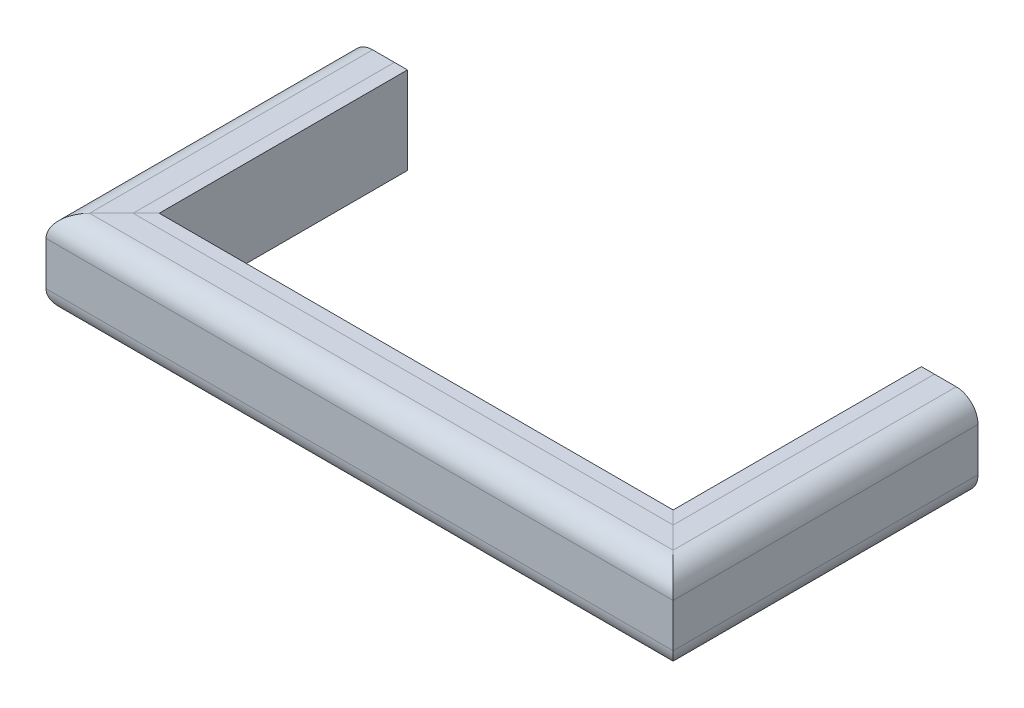
ISO-10303-21;
HEADER;
FILE_DESCRIPTION(('STEP AP214'),'2;1');
FILE_NAME('part.step','',(''),(''),'','','');
FILE_SCHEMA(('AUTOMOTIVE_DESIGN { 1 0 10303 214 1 1 1 1 }'));
ENDSEC;
DATA;
#1=APPLICATION_CONTEXT('core data for automotive mechanical design processes');
#2=APPLICATION_PROTOCOL_DEFINITION('international standard','automotive_design',2000,#1);
#3=PRODUCT_CONTEXT('',#1,'mechanical');
#4=PRODUCT('Part','Part','',(#3));
#5=PRODUCT_RELATED_PRODUCT_CATEGORY('part','',(#4));
#6=PRODUCT_DEFINITION_FORMATION('','',#4);
#7=PRODUCT_DEFINITION_CONTEXT('part definition',#1,'design');
#8=PRODUCT_DEFINITION('design','',#6,#7);
#9=PRODUCT_DEFINITION_SHAPE('','',#8);
#10=(LENGTH_UNIT() NAMED_UNIT(*) SI_UNIT(.MILLI.,.METRE.));
#11=(NAMED_UNIT(*) PLANE_ANGLE_UNIT() SI_UNIT($,.RADIAN.));
#12=(NAMED_UNIT(*) SI_UNIT($,.STERADIAN.) SOLID_ANGLE_UNIT());
#13=UNCERTAINTY_MEASURE_WITH_UNIT(LENGTH_MEASURE(1.E-05),#10,'distance_accuracy_value','');
#14=(GEOMETRIC_REPRESENTATION_CONTEXT(3) GLOBAL_UNCERTAINTY_ASSIGNED_CONTEXT((#13)) GLOBAL_UNIT_ASSIGNED_CONTEXT((#10,
#11,#12)) REPRESENTATION_CONTEXT('',''));
#15=CARTESIAN_POINT('',(0.,0.,0.));
#16=DIRECTION('',(0.,0.,1.));
#17=DIRECTION('',(1.,0.,0.));
#18=AXIS2_PLACEMENT_3D('',#15,#16,#17);
#19=CARTESIAN_POINT('',(425.45,95.2500000000001,0.));
#20=DIRECTION('',(0.,0.,-1.));
#21=DIRECTION('',(-1.,0.,0.));
#22=AXIS2_PLACEMENT_3D('',#19,#20,#21);
#23=PLANE('',#22);
#24=DIRECTION('',(0.,1.,0.));
#25=VECTOR('',#24,1.);
#26=CARTESIAN_POINT('',(374.65,0.,0.));
#27=LINE('',#26,#25);
#28=CARTESIAN_POINT('',(374.65,0.,0.));
#29=VERTEX_POINT('',#28);
#30=CARTESIAN_POINT('',(374.65,127.,0.));
#31=VERTEX_POINT('',#30);
#32=EDGE_CURVE('E107',#29,#31,#27,.T.);
#33=ORIENTED_EDGE('',*,*,#32,.T.);
#34=DIRECTION('',(1.,0.,0.));
#35=VECTOR('',#34,1.);
#36=CARTESIAN_POINT('',(374.65,127.,0.));
#37=LINE('',#36,#35);
#38=CARTESIAN_POINT('',(393.7,127.,0.));
#39=VERTEX_POINT('',#38);
#40=EDGE_CURVE('E126',#31,#39,#37,.T.);
#41=ORIENTED_EDGE('',*,*,#40,.T.);
#42=DIRECTION('',(1.,0.,0.));
#43=VECTOR('',#42,1.);
#44=CARTESIAN_POINT('',(393.7,127.,0.));
#45=LINE('',#44,#43);
#46=CARTESIAN_POINT('',(425.45,127.,0.));
#47=VERTEX_POINT('',#46);
#48=EDGE_CURVE('E153',#39,#47,#45,.T.);
#49=ORIENTED_EDGE('',*,*,#48,.T.);
#50=CARTESIAN_POINT('',(425.45,95.2500000000001,0.));
#51=DIRECTION('',(0.,0.,-1.));
#52=DIRECTION('',(-1.,0.,0.));
#53=AXIS2_PLACEMENT_3D('',#50,#51,#52);
#54=CIRCLE('',#53,31.75);
#55=CARTESIAN_POINT('',(457.2,95.2500000000001,0.));
#56=VERTEX_POINT('',#55);
#57=EDGE_CURVE('E155',#47,#56,#54,.T.);
#58=ORIENTED_EDGE('',*,*,#57,.T.);
#59=DIRECTION('',(0.,-1.,0.));
#60=VECTOR('',#59,1.);
#61=CARTESIAN_POINT('',(457.2,95.2500000000001,0.));
#62=LINE('',#61,#60);
#63=CARTESIAN_POINT('',(457.2,31.7500000000001,0.));
#64=VERTEX_POINT('',#63);
#65=EDGE_CURVE('E157',#56,#64,#62,.T.);
#66=ORIENTED_EDGE('',*,*,#65,.T.);
#67=CARTESIAN_POINT('',(425.45,31.7500000000001,0.));
#68=DIRECTION('',(0.,0.,-1.));
#69=DIRECTION('',(-1.,0.,0.));
#70=AXIS2_PLACEMENT_3D('',#67,#68,#69);
#71=CIRCLE('',#70,31.75);
#72=CARTESIAN_POINT('',(425.45,0.,0.));
#73=VERTEX_POINT('',#72);
#74=EDGE_CURVE('E159',#64,#73,#71,.T.);
#75=ORIENTED_EDGE('',*,*,#74,.T.);
#76=DIRECTION('',(-1.,0.,0.));
#77=VECTOR('',#76,1.);
#78=CARTESIAN_POINT('',(425.45,0.,0.));
#79=LINE('',#78,#77);
#80=CARTESIAN_POINT('',(393.7,0.,0.));
#81=VERTEX_POINT('',#80);
#82=EDGE_CURVE('E112',#73,#81,#79,.T.);
#83=ORIENTED_EDGE('',*,*,#82,.T.);
#84=DIRECTION('',(-1.,0.,0.));
#85=VECTOR('',#84,1.);
#86=CARTESIAN_POINT('',(374.65,0.,0.));
#87=LINE('',#86,#85);
#88=EDGE_CURVE('E110',#81,#29,#87,.T.);
#89=ORIENTED_EDGE('',*,*,#88,.T.);
#90=EDGE_LOOP('',(#33,#41,#49,#58,#66,#75,#83,#89));
#91=FACE_BOUND('',#90,.T.);
#92=ADVANCED_FACE('F37',(#91),#23,.T.);
#93=CARTESIAN_POINT('',(-425.45,95.2500000000001,0.));
#94=DIRECTION('',(0.,0.,1.));
#95=DIRECTION('',(1.,0.,0.));
#96=AXIS2_PLACEMENT_3D('',#93,#94,#95);
#97=PLANE('',#96);
#98=DIRECTION('',(0.,1.,0.));
#99=VECTOR('',#98,1.);
#100=CARTESIAN_POINT('',(-374.65,0.,0.));
#101=LINE('',#100,#99);
#102=CARTESIAN_POINT('',(-374.65,0.,0.));
#103=VERTEX_POINT('',#102);
#104=CARTESIAN_POINT('',(-374.65,127.,0.));
#105=VERTEX_POINT('',#104);
#106=EDGE_CURVE('E202',#103,#105,#101,.T.);
#107=ORIENTED_EDGE('',*,*,#106,.F.);
#108=DIRECTION('',(1.,0.,0.));
#109=VECTOR('',#108,1.);
#110=CARTESIAN_POINT('',(-374.65,0.,0.));
#111=LINE('',#110,#109);
#112=CARTESIAN_POINT('',(-393.7,0.,0.));
#113=VERTEX_POINT('',#112);
#114=EDGE_CURVE('E208',#113,#103,#111,.T.);
#115=ORIENTED_EDGE('',*,*,#114,.F.);
#116=DIRECTION('',(1.,0.,0.));
#117=VECTOR('',#116,1.);
#118=CARTESIAN_POINT('',(-425.45,0.,0.));
#119=LINE('',#118,#117);
#120=CARTESIAN_POINT('',(-425.45,0.,0.));
#121=VERTEX_POINT('',#120);
#122=EDGE_CURVE('E212',#121,#113,#119,.T.);
#123=ORIENTED_EDGE('',*,*,#122,.F.);
#124=CARTESIAN_POINT('',(-425.45,31.7500000000001,0.));
#125=DIRECTION('',(0.,0.,1.));
#126=DIRECTION('',(1.,0.,0.));
#127=AXIS2_PLACEMENT_3D('',#124,#125,#126);
#128=CIRCLE('',#127,31.75);
#129=CARTESIAN_POINT('',(-457.2,31.7500000000001,0.));
#130=VERTEX_POINT('',#129);
#131=EDGE_CURVE('E218',#130,#121,#128,.T.);
#132=ORIENTED_EDGE('',*,*,#131,.F.);
#133=DIRECTION('',(0.,-1.,0.));
#134=VECTOR('',#133,1.);
#135=CARTESIAN_POINT('',(-457.2,95.2500000000001,0.));
#136=LINE('',#135,#134);
#137=CARTESIAN_POINT('',(-457.2,95.2500000000001,0.));
#138=VERTEX_POINT('',#137);
#139=EDGE_CURVE('E224',#138,#130,#136,.T.);
#140=ORIENTED_EDGE('',*,*,#139,.F.);
#141=CARTESIAN_POINT('',(-425.45,95.2500000000001,0.));
#142=DIRECTION('',(0.,0.,1.));
#143=DIRECTION('',(1.,0.,0.));
#144=AXIS2_PLACEMENT_3D('',#141,#142,#143);
#145=CIRCLE('',#144,31.75);
#146=CARTESIAN_POINT('',(-425.45,127.,0.));
#147=VERTEX_POINT('',#146);
#148=EDGE_CURVE('E230',#147,#138,#145,.T.);
#149=ORIENTED_EDGE('',*,*,#148,.F.);
#150=DIRECTION('',(-1.,0.,0.));
#151=VECTOR('',#150,1.);
#152=CARTESIAN_POINT('',(-393.7,127.,0.));
#153=LINE('',#152,#151);
#154=CARTESIAN_POINT('',(-393.7,127.,0.));
#155=VERTEX_POINT('',#154);
#156=EDGE_CURVE('E236',#155,#147,#153,.T.);
#157=ORIENTED_EDGE('',*,*,#156,.F.);
#158=DIRECTION('',(-1.,0.,0.));
#159=VECTOR('',#158,1.);
#160=CARTESIAN_POINT('',(-374.65,127.,0.));
#161=LINE('',#160,#159);
#162=EDGE_CURVE('E242',#105,#155,#161,.T.);
#163=ORIENTED_EDGE('',*,*,#162,.F.);
#164=EDGE_LOOP('',(#107,#115,#123,#132,#140,#149,#157,#163));
#165=FACE_BOUND('',#164,.T.);
#166=ADVANCED_FACE('F287',(#165),#97,.F.);
#167=CARTESIAN_POINT('',(374.65,0.,452.855));
#168=DIRECTION('',(-1.,0.,0.));
#169=DIRECTION('',(0.,-1.,0.));
#170=AXIS2_PLACEMENT_3D('',#167,#168,#169);
#171=PLANE('',#170);
#172=DIRECTION('',(0.,-1.,0.));
#173=VECTOR('',#172,1.);
#174=CARTESIAN_POINT('',(374.65,-2.98427886467586E-13,361.95));
#175=LINE('',#174,#173);
#176=CARTESIAN_POINT('',(374.65,127.,361.95));
#177=VERTEX_POINT('',#176);
#178=CARTESIAN_POINT('',(374.65,0.,361.95));
#179=VERTEX_POINT('',#178);
#180=EDGE_CURVE('E162',#177,#179,#175,.T.);
#181=ORIENTED_EDGE('',*,*,#180,.F.);
#182=DIRECTION('',(0.,0.,-1.));
#183=VECTOR('',#182,1.);
#184=CARTESIAN_POINT('',(374.65,127.,452.855));
#185=LINE('',#184,#183);
#186=EDGE_CURVE('E124',#177,#31,#185,.T.);
#187=ORIENTED_EDGE('',*,*,#186,.T.);
#188=ORIENTED_EDGE('',*,*,#32,.F.);
#189=DIRECTION('',(0.,0.,-1.));
#190=VECTOR('',#189,1.);
#191=CARTESIAN_POINT('',(374.65,0.,452.855));
#192=LINE('',#191,#190);
#193=EDGE_CURVE('E40',#179,#29,#192,.T.);
#194=ORIENTED_EDGE('',*,*,#193,.F.);
#195=EDGE_LOOP('',(#181,#187,#188,#194));
#196=FACE_BOUND('',#195,.T.);
#197=ADVANCED_FACE('F121',(#196),#171,.T.);
#198=CARTESIAN_POINT('',(374.65,127.,452.855));
#199=DIRECTION('',(0.,1.,0.));
#200=DIRECTION('',(0.,0.,1.));
#201=AXIS2_PLACEMENT_3D('',#198,#199,#200);
#202=PLANE('',#201);
#203=DIRECTION('',(-0.707106781186548,0.,-0.707106781186548));
#204=VECTOR('',#203,1.);
#205=CARTESIAN_POINT('',(-45.4525,127.,-58.1524999999999));
#206=LINE('',#205,#204);
#207=CARTESIAN_POINT('',(393.7,127.,381.));
#208=VERTEX_POINT('',#207);
#209=EDGE_CURVE('E199',#208,#177,#206,.T.);
#210=ORIENTED_EDGE('',*,*,#209,.F.);
#211=DIRECTION('',(0.,0.,-1.));
#212=VECTOR('',#211,1.);
#213=CARTESIAN_POINT('',(393.7,127.,452.855));
#214=LINE('',#213,#212);
#215=EDGE_CURVE('E135',#208,#39,#214,.T.);
#216=ORIENTED_EDGE('',*,*,#215,.T.);
#217=ORIENTED_EDGE('',*,*,#40,.F.);
#218=ORIENTED_EDGE('',*,*,#186,.F.);
#219=EDGE_LOOP('',(#210,#216,#217,#218));
#220=FACE_BOUND('',#219,.T.);
#221=ADVANCED_FACE('F357',(#220),#202,.T.);
#222=CARTESIAN_POINT('',(393.7,127.,452.855));
#223=DIRECTION('',(0.,1.,0.));
#224=DIRECTION('',(0.,0.,1.));
#225=AXIS2_PLACEMENT_3D('',#222,#223,#224);
#226=PLANE('',#225);
#227=DIRECTION('',(-0.707106781186548,0.,-0.707106781186548));
#228=VECTOR('',#227,1.);
#229=CARTESIAN_POINT('',(-35.9275000000001,127.,-48.6274999999999));
#230=LINE('',#229,#228);
#231=CARTESIAN_POINT('',(425.45,127.,412.75));
#232=VERTEX_POINT('',#231);
#233=EDGE_CURVE('E196',#232,#208,#230,.T.);
#234=ORIENTED_EDGE('',*,*,#233,.F.);
#235=DIRECTION('',(0.,0.,-1.));
#236=VECTOR('',#235,1.);
#237=CARTESIAN_POINT('',(425.45,127.,452.855));
#238=LINE('',#237,#236);
#239=EDGE_CURVE('E137',#232,#47,#238,.T.);
#240=ORIENTED_EDGE('',*,*,#239,.T.);
#241=ORIENTED_EDGE('',*,*,#48,.F.);
#242=ORIENTED_EDGE('',*,*,#215,.F.);
#243=EDGE_LOOP('',(#234,#240,#241,#242));
#244=FACE_BOUND('',#243,.T.);
#245=ADVANCED_FACE('F363',(#244),#226,.T.);
#246=CARTESIAN_POINT('',(425.45,95.2500000000001,452.855));
#247=DIRECTION('',(0.,0.,-1.));
#248=DIRECTION('',(-1.,0.,0.));
#249=AXIS2_PLACEMENT_3D('',#246,#247,#248);
#250=CYLINDRICAL_SURFACE('',#249,31.75);
#251=CARTESIAN_POINT('',(425.45,95.2500000000001,412.75));
#252=DIRECTION('',(0.707106781186547,0.,-0.707106781186547));
#253=DIRECTION('',(0.707106781186548,0.,0.707106781186548));
#254=AXIS2_PLACEMENT_3D('',#251,#252,#253);
#255=ELLIPSE('',#254,44.9012806053457,31.75);
#256=CARTESIAN_POINT('',(457.2,95.2500000000001,444.5));
#257=VERTEX_POINT('',#256);
#258=EDGE_CURVE('E193',#257,#232,#255,.F.);
#259=ORIENTED_EDGE('',*,*,#258,.F.);
#260=DIRECTION('',(0.,0.,-1.));
#261=VECTOR('',#260,1.);
#262=CARTESIAN_POINT('',(457.2,95.2500000000001,452.855));
#263=LINE('',#262,#261);
#264=EDGE_CURVE('E142',#257,#56,#263,.T.);
#265=ORIENTED_EDGE('',*,*,#264,.T.);
#266=ORIENTED_EDGE('',*,*,#57,.F.);
#267=ORIENTED_EDGE('',*,*,#239,.F.);
#268=EDGE_LOOP('',(#259,#265,#266,#267));
#269=FACE_BOUND('',#268,.T.);
#270=ADVANCED_FACE('F367',(#269),#250,.T.);
#271=CARTESIAN_POINT('',(457.2,95.2500000000001,452.855));
#272=DIRECTION('',(1.,0.,0.));
#273=DIRECTION('',(0.,1.,0.));
#274=AXIS2_PLACEMENT_3D('',#271,#272,#273);
#275=PLANE('',#274);
#276=DIRECTION('',(0.,1.,0.));
#277=VECTOR('',#276,1.);
#278=CARTESIAN_POINT('',(457.2,95.2499999999993,444.5));
#279=LINE('',#278,#277);
#280=CARTESIAN_POINT('',(457.2,31.7500000000001,444.5));
#281=VERTEX_POINT('',#280);
#282=EDGE_CURVE('E190',#281,#257,#279,.T.);
#283=ORIENTED_EDGE('',*,*,#282,.F.);
#284=DIRECTION('',(0.,0.,-1.));
#285=VECTOR('',#284,1.);
#286=CARTESIAN_POINT('',(457.2,31.7500000000001,452.855));
#287=LINE('',#286,#285);
#288=EDGE_CURVE('E145',#281,#64,#287,.T.);
#289=ORIENTED_EDGE('',*,*,#288,.T.);
#290=ORIENTED_EDGE('',*,*,#65,.F.);
#291=ORIENTED_EDGE('',*,*,#264,.F.);
#292=EDGE_LOOP('',(#283,#289,#290,#291));
#293=FACE_BOUND('',#292,.T.);
#294=ADVANCED_FACE('F372',(#293),#275,.T.);
#295=CARTESIAN_POINT('',(425.45,31.7500000000001,452.855));
#296=DIRECTION('',(0.,0.,-1.));
#297=DIRECTION('',(-1.,0.,0.));
#298=AXIS2_PLACEMENT_3D('',#295,#296,#297);
#299=CYLINDRICAL_SURFACE('',#298,31.75);
#300=CARTESIAN_POINT('',(425.45,31.7500000000001,412.75));
#301=DIRECTION('',(0.707106781186547,0.,-0.707106781186547));
#302=DIRECTION('',(0.707106781186548,0.,0.707106781186548));
#303=AXIS2_PLACEMENT_3D('',#300,#301,#302);
#304=ELLIPSE('',#303,44.9012806053458,31.75);
#305=CARTESIAN_POINT('',(425.45,0.,412.75));
#306=VERTEX_POINT('',#305);
#307=EDGE_CURVE('E187',#306,#281,#304,.F.);
#308=ORIENTED_EDGE('',*,*,#307,.F.);
#309=DIRECTION('',(0.,0.,-1.));
#310=VECTOR('',#309,1.);
#311=CARTESIAN_POINT('',(425.45,0.,452.855));
#312=LINE('',#311,#310);
#313=EDGE_CURVE('E148',#306,#73,#312,.T.);
#314=ORIENTED_EDGE('',*,*,#313,.T.);
#315=ORIENTED_EDGE('',*,*,#74,.F.);
#316=ORIENTED_EDGE('',*,*,#288,.F.);
#317=EDGE_LOOP('',(#308,#314,#315,#316));
#318=FACE_BOUND('',#317,.T.);
#319=ADVANCED_FACE('F375',(#318),#299,.T.);
#320=CARTESIAN_POINT('',(425.45,0.,452.855));
#321=DIRECTION('',(0.,-1.,0.));
#322=DIRECTION('',(1.,0.,0.));
#323=AXIS2_PLACEMENT_3D('',#320,#321,#322);
#324=PLANE('',#323);
#325=DIRECTION('',(0.707106781186548,0.,0.707106781186548));
#326=VECTOR('',#325,1.);
#327=CARTESIAN_POINT('',(-20.0525,0.,-32.7524999999999));
#328=LINE('',#327,#326);
#329=CARTESIAN_POINT('',(393.7,0.,381.));
#330=VERTEX_POINT('',#329);
#331=EDGE_CURVE('E184',#330,#306,#328,.T.);
#332=ORIENTED_EDGE('',*,*,#331,.F.);
#333=DIRECTION('',(0.,0.,-1.));
#334=VECTOR('',#333,1.);
#335=CARTESIAN_POINT('',(393.7,0.,452.855));
#336=LINE('',#335,#334);
#337=EDGE_CURVE('E125',#330,#81,#336,.T.);
#338=ORIENTED_EDGE('',*,*,#337,.T.);
#339=ORIENTED_EDGE('',*,*,#82,.F.);
#340=ORIENTED_EDGE('',*,*,#313,.F.);
#341=EDGE_LOOP('',(#332,#338,#339,#340));
#342=FACE_BOUND('',#341,.T.);
#343=ADVANCED_FACE('F352',(#342),#324,.T.);
#344=CARTESIAN_POINT('',(374.65,0.,452.855));
#345=DIRECTION('',(0.,-1.,0.));
#346=DIRECTION('',(1.,0.,0.));
#347=AXIS2_PLACEMENT_3D('',#344,#345,#346);
#348=PLANE('',#347);
#349=DIRECTION('',(0.707106781186548,0.,0.707106781186548));
#350=VECTOR('',#349,1.);
#351=CARTESIAN_POINT('',(-45.4525,1.72372369039822E-12,-58.1524999999999));
#352=LINE('',#351,#350);
#353=EDGE_CURVE('E130',#179,#330,#352,.T.);
#354=ORIENTED_EDGE('',*,*,#353,.F.);
#355=ORIENTED_EDGE('',*,*,#193,.T.);
#356=ORIENTED_EDGE('',*,*,#88,.F.);
#357=ORIENTED_EDGE('',*,*,#337,.F.);
#358=EDGE_LOOP('',(#354,#355,#356,#357));
#359=FACE_BOUND('',#358,.T.);
#360=ADVANCED_FACE('F128',(#359),#348,.T.);
#361=CARTESIAN_POINT('',(-465.555,0.,361.95));
#362=DIRECTION('',(0.,-1.,0.));
#363=DIRECTION('',(0.,0.,-1.));
#364=AXIS2_PLACEMENT_3D('',#361,#362,#363);
#365=PLANE('',#364);
#366=DIRECTION('',(1.,0.,0.));
#367=VECTOR('',#366,1.);
#368=CARTESIAN_POINT('',(-465.555,0.,361.95));
#369=LINE('',#368,#367);
#370=CARTESIAN_POINT('',(-374.65,0.,361.95));
#371=VERTEX_POINT('',#370);
#372=EDGE_CURVE('E164',#371,#179,#369,.T.);
#373=ORIENTED_EDGE('',*,*,#372,.T.);
#374=ORIENTED_EDGE('',*,*,#353,.T.);
#375=DIRECTION('',(1.,0.,0.));
#376=VECTOR('',#375,1.);
#377=CARTESIAN_POINT('',(-465.555,0.,381.));
#378=LINE('',#377,#376);
#379=CARTESIAN_POINT('',(-393.7,0.,381.));
#380=VERTEX_POINT('',#379);
#381=EDGE_CURVE('E131',#380,#330,#378,.T.);
#382=ORIENTED_EDGE('',*,*,#381,.F.);
#383=DIRECTION('',(-0.707106781186548,0.,0.707106781186548));
#384=VECTOR('',#383,1.);
#385=CARTESIAN_POINT('',(-193.675,7.81733383725226E-13,180.975));
#386=LINE('',#385,#384);
#387=EDGE_CURVE('E206',#371,#380,#386,.T.);
#388=ORIENTED_EDGE('',*,*,#387,.F.);
#389=EDGE_LOOP('',(#373,#374,#382,#388));
#390=FACE_BOUND('',#389,.T.);
#391=ADVANCED_FACE('F353',(#390),#365,.T.);
#392=CARTESIAN_POINT('',(-465.555,0.,412.75));
#393=DIRECTION('',(0.,-1.,0.));
#394=DIRECTION('',(0.,0.,-1.));
#395=AXIS2_PLACEMENT_3D('',#392,#393,#394);
#396=PLANE('',#395);
#397=ORIENTED_EDGE('',*,*,#381,.T.);
#398=ORIENTED_EDGE('',*,*,#331,.T.);
#399=DIRECTION('',(1.,0.,0.));
#400=VECTOR('',#399,1.);
#401=CARTESIAN_POINT('',(-465.555,0.,412.75));
#402=LINE('',#401,#400);
#403=CARTESIAN_POINT('',(-425.45,0.,412.75));
#404=VERTEX_POINT('',#403);
#405=EDGE_CURVE('E133',#404,#306,#402,.T.);
#406=ORIENTED_EDGE('',*,*,#405,.F.);
#407=DIRECTION('',(-0.707106781186548,0.,0.707106781186548));
#408=VECTOR('',#407,1.);
#409=CARTESIAN_POINT('',(-219.075,0.,206.375));
#410=LINE('',#409,#408);
#411=EDGE_CURVE('E256',#380,#404,#410,.T.);
#412=ORIENTED_EDGE('',*,*,#411,.F.);
#413=EDGE_LOOP('',(#397,#398,#406,#412));
#414=FACE_BOUND('',#413,.T.);
#415=ADVANCED_FACE('F349',(#414),#396,.T.);
#416=CARTESIAN_POINT('',(-465.555,31.7500000000001,412.75));
#417=DIRECTION('',(1.,0.,0.));
#418=DIRECTION('',(0.,0.,-1.));
#419=AXIS2_PLACEMENT_3D('',#416,#417,#418);
#420=CYLINDRICAL_SURFACE('',#419,31.75);
#421=ORIENTED_EDGE('',*,*,#405,.T.);
#422=ORIENTED_EDGE('',*,*,#307,.T.);
#423=DIRECTION('',(1.,0.,0.));
#424=VECTOR('',#423,1.);
#425=CARTESIAN_POINT('',(-465.555,31.7500000000001,444.5));
#426=LINE('',#425,#424);
#427=CARTESIAN_POINT('',(-457.2,31.7500000000001,444.5));
#428=VERTEX_POINT('',#427);
#429=EDGE_CURVE('E178',#428,#281,#426,.T.);
#430=ORIENTED_EDGE('',*,*,#429,.F.);
#431=CARTESIAN_POINT('',(-425.45,31.7500000000001,412.75));
#432=DIRECTION('',(0.707106781186547,0.,0.707106781186547));
#433=DIRECTION('',(-0.707106781186548,0.,0.707106781186548));
#434=AXIS2_PLACEMENT_3D('',#431,#432,#433);
#435=ELLIPSE('',#434,44.9012806053458,31.75);
#436=EDGE_CURVE('E259',#404,#428,#435,.F.);
#437=ORIENTED_EDGE('',*,*,#436,.F.);
#438=EDGE_LOOP('',(#421,#422,#430,#437));
#439=FACE_BOUND('',#438,.T.);
#440=ADVANCED_FACE('F347',(#439),#420,.T.);
#441=CARTESIAN_POINT('',(-465.555,95.2500000000001,444.5));
#442=DIRECTION('',(0.,0.,1.));
#443=DIRECTION('',(0.,-1.,0.));
#444=AXIS2_PLACEMENT_3D('',#441,#442,#443);
#445=PLANE('',#444);
#446=ORIENTED_EDGE('',*,*,#429,.T.);
#447=ORIENTED_EDGE('',*,*,#282,.T.);
#448=DIRECTION('',(1.,0.,0.));
#449=VECTOR('',#448,1.);
#450=CARTESIAN_POINT('',(-465.555,95.2500000000001,444.5));
#451=LINE('',#450,#449);
#452=CARTESIAN_POINT('',(-457.2,95.2500000000001,444.5));
#453=VERTEX_POINT('',#452);
#454=EDGE_CURVE('E175',#453,#257,#451,.T.);
#455=ORIENTED_EDGE('',*,*,#454,.F.);
#456=DIRECTION('',(0.,1.,0.));
#457=VECTOR('',#456,1.);
#458=CARTESIAN_POINT('',(-457.2,95.2499999999997,444.5));
#459=LINE('',#458,#457);
#460=EDGE_CURVE('E262',#428,#453,#459,.T.);
#461=ORIENTED_EDGE('',*,*,#460,.F.);
#462=EDGE_LOOP('',(#446,#447,#455,#461));
#463=FACE_BOUND('',#462,.T.);
#464=ADVANCED_FACE('F323',(#463),#445,.T.);
#465=CARTESIAN_POINT('',(-465.555,95.2500000000001,412.75));
#466=DIRECTION('',(1.,0.,0.));
#467=DIRECTION('',(0.,0.,-1.));
#468=AXIS2_PLACEMENT_3D('',#465,#466,#467);
#469=CYLINDRICAL_SURFACE('',#468,31.75);
#470=ORIENTED_EDGE('',*,*,#454,.T.);
#471=ORIENTED_EDGE('',*,*,#258,.T.);
#472=DIRECTION('',(1.,0.,0.));
#473=VECTOR('',#472,1.);
#474=CARTESIAN_POINT('',(-465.555,127.,412.75));
#475=LINE('',#474,#473);
#476=CARTESIAN_POINT('',(-425.45,127.,412.75));
#477=VERTEX_POINT('',#476);
#478=EDGE_CURVE('E172',#477,#232,#475,.T.);
#479=ORIENTED_EDGE('',*,*,#478,.F.);
#480=CARTESIAN_POINT('',(-425.45,95.2500000000001,412.75));
#481=DIRECTION('',(0.707106781186547,0.,0.707106781186547));
#482=DIRECTION('',(-0.707106781186548,0.,0.707106781186548));
#483=AXIS2_PLACEMENT_3D('',#480,#481,#482);
#484=ELLIPSE('',#483,44.9012806053457,31.75);
#485=EDGE_CURVE('E265',#453,#477,#484,.F.);
#486=ORIENTED_EDGE('',*,*,#485,.F.);
#487=EDGE_LOOP('',(#470,#471,#479,#486));
#488=FACE_BOUND('',#487,.T.);
#489=ADVANCED_FACE('F320',(#488),#469,.T.);
#490=CARTESIAN_POINT('',(-465.555,127.,381.));
#491=DIRECTION('',(0.,1.,0.));
#492=DIRECTION('',(0.,0.,1.));
#493=AXIS2_PLACEMENT_3D('',#490,#491,#492);
#494=PLANE('',#493);
#495=ORIENTED_EDGE('',*,*,#478,.T.);
#496=ORIENTED_EDGE('',*,*,#233,.T.);
#497=DIRECTION('',(1.,0.,0.));
#498=VECTOR('',#497,1.);
#499=CARTESIAN_POINT('',(-465.555,127.,381.));
#500=LINE('',#499,#498);
#501=CARTESIAN_POINT('',(-393.7,127.,381.));
#502=VERTEX_POINT('',#501);
#503=EDGE_CURVE('E170',#502,#208,#500,.T.);
#504=ORIENTED_EDGE('',*,*,#503,.F.);
#505=DIRECTION('',(0.707106781186548,0.,-0.707106781186548));
#506=VECTOR('',#505,1.);
#507=CARTESIAN_POINT('',(-203.2,127.,190.5));
#508=LINE('',#507,#506);
#509=EDGE_CURVE('E46',#477,#502,#508,.T.);
#510=ORIENTED_EDGE('',*,*,#509,.F.);
#511=EDGE_LOOP('',(#495,#496,#504,#510));
#512=FACE_BOUND('',#511,.T.);
#513=ADVANCED_FACE('F360',(#512),#494,.T.);
#514=CARTESIAN_POINT('',(-465.555,127.,361.95));
#515=DIRECTION('',(0.,1.,0.));
#516=DIRECTION('',(0.,0.,1.));
#517=AXIS2_PLACEMENT_3D('',#514,#515,#516);
#518=PLANE('',#517);
#519=ORIENTED_EDGE('',*,*,#503,.T.);
#520=ORIENTED_EDGE('',*,*,#209,.T.);
#521=DIRECTION('',(1.,0.,0.));
#522=VECTOR('',#521,1.);
#523=CARTESIAN_POINT('',(-465.555,127.,361.95));
#524=LINE('',#523,#522);
#525=CARTESIAN_POINT('',(-374.65,127.,361.95));
#526=VERTEX_POINT('',#525);
#527=EDGE_CURVE('E167',#526,#177,#524,.T.);
#528=ORIENTED_EDGE('',*,*,#527,.F.);
#529=DIRECTION('',(0.707106781186548,0.,-0.707106781186548));
#530=VECTOR('',#529,1.);
#531=CARTESIAN_POINT('',(-193.675,127.,180.975));
#532=LINE('',#531,#530);
#533=EDGE_CURVE('E11',#502,#526,#532,.T.);
#534=ORIENTED_EDGE('',*,*,#533,.F.);
#535=EDGE_LOOP('',(#519,#520,#528,#534));
#536=FACE_BOUND('',#535,.T.);
#537=ADVANCED_FACE('F359',(#536),#518,.T.);
#538=CARTESIAN_POINT('',(-465.555,0.,361.95));
#539=DIRECTION('',(0.,0.,-1.));
#540=DIRECTION('',(0.,1.,0.));
#541=AXIS2_PLACEMENT_3D('',#538,#539,#540);
#542=PLANE('',#541);
#543=ORIENTED_EDGE('',*,*,#527,.T.);
#544=ORIENTED_EDGE('',*,*,#180,.T.);
#545=ORIENTED_EDGE('',*,*,#372,.F.);
#546=DIRECTION('',(0.,-1.,0.));
#547=VECTOR('',#546,1.);
#548=CARTESIAN_POINT('',(-374.65,0.,361.95));
#549=LINE('',#548,#547);
#550=EDGE_CURVE('E203',#526,#371,#549,.T.);
#551=ORIENTED_EDGE('',*,*,#550,.F.);
#552=EDGE_LOOP('',(#543,#544,#545,#551));
#553=FACE_BOUND('',#552,.T.);
#554=ADVANCED_FACE('F355',(#553),#542,.T.);
#555=CARTESIAN_POINT('',(-374.65,0.,0.));
#556=DIRECTION('',(0.,-1.,0.));
#557=DIRECTION('',(1.,0.,0.));
#558=AXIS2_PLACEMENT_3D('',#555,#556,#557);
#559=PLANE('',#558);
#560=DIRECTION('',(0.,0.,1.));
#561=VECTOR('',#560,1.);
#562=CARTESIAN_POINT('',(-374.65,0.,0.));
#563=LINE('',#562,#561);
#564=EDGE_CURVE('E211',#103,#371,#563,.T.);
#565=ORIENTED_EDGE('',*,*,#564,.T.);
#566=ORIENTED_EDGE('',*,*,#387,.T.);
#567=DIRECTION('',(0.,0.,1.));
#568=VECTOR('',#567,1.);
#569=CARTESIAN_POINT('',(-393.7,0.,0.));
#570=LINE('',#569,#568);
#571=EDGE_CURVE('E207',#113,#380,#570,.T.);
#572=ORIENTED_EDGE('',*,*,#571,.F.);
#573=ORIENTED_EDGE('',*,*,#114,.T.);
#574=EDGE_LOOP('',(#565,#566,#572,#573));
#575=FACE_BOUND('',#574,.T.);
#576=ADVANCED_FACE('F298',(#575),#559,.T.);
#577=CARTESIAN_POINT('',(-425.45,0.,0.));
#578=DIRECTION('',(0.,-1.,0.));
#579=DIRECTION('',(1.,0.,0.));
#580=AXIS2_PLACEMENT_3D('',#577,#578,#579);
#581=PLANE('',#580);
#582=ORIENTED_EDGE('',*,*,#571,.T.);
#583=ORIENTED_EDGE('',*,*,#411,.T.);
#584=DIRECTION('',(0.,0.,1.));
#585=VECTOR('',#584,1.);
#586=CARTESIAN_POINT('',(-425.45,0.,0.));
#587=LINE('',#586,#585);
#588=EDGE_CURVE('E215',#121,#404,#587,.T.);
#589=ORIENTED_EDGE('',*,*,#588,.F.);
#590=ORIENTED_EDGE('',*,*,#122,.T.);
#591=EDGE_LOOP('',(#582,#583,#589,#590));
#592=FACE_BOUND('',#591,.T.);
#593=ADVANCED_FACE('F342',(#592),#581,.T.);
#594=CARTESIAN_POINT('',(-425.45,31.7500000000001,0.));
#595=DIRECTION('',(0.,0.,1.));
#596=DIRECTION('',(1.,0.,0.));
#597=AXIS2_PLACEMENT_3D('',#594,#595,#596);
#598=CYLINDRICAL_SURFACE('',#597,31.75);
#599=ORIENTED_EDGE('',*,*,#588,.T.);
#600=ORIENTED_EDGE('',*,*,#436,.T.);
#601=DIRECTION('',(0.,0.,1.));
#602=VECTOR('',#601,1.);
#603=CARTESIAN_POINT('',(-457.2,31.7500000000001,0.));
#604=LINE('',#603,#602);
#605=EDGE_CURVE('E221',#130,#428,#604,.T.);
#606=ORIENTED_EDGE('',*,*,#605,.F.);
#607=ORIENTED_EDGE('',*,*,#131,.T.);
#608=EDGE_LOOP('',(#599,#600,#606,#607));
#609=FACE_BOUND('',#608,.T.);
#610=ADVANCED_FACE('F344',(#609),#598,.T.);
#611=CARTESIAN_POINT('',(-457.2,95.2500000000001,0.));
#612=DIRECTION('',(-1.,0.,0.));
#613=DIRECTION('',(0.,-1.,0.));
#614=AXIS2_PLACEMENT_3D('',#611,#612,#613);
#615=PLANE('',#614);
#616=ORIENTED_EDGE('',*,*,#605,.T.);
#617=ORIENTED_EDGE('',*,*,#460,.T.);
#618=DIRECTION('',(0.,0.,1.));
#619=VECTOR('',#618,1.);
#620=CARTESIAN_POINT('',(-457.2,95.2500000000001,0.));
#621=LINE('',#620,#619);
#622=EDGE_CURVE('E227',#138,#453,#621,.T.);
#623=ORIENTED_EDGE('',*,*,#622,.F.);
#624=ORIENTED_EDGE('',*,*,#139,.T.);
#625=EDGE_LOOP('',(#616,#617,#623,#624));
#626=FACE_BOUND('',#625,.T.);
#627=ADVANCED_FACE('F327',(#626),#615,.T.);
#628=CARTESIAN_POINT('',(-425.45,95.2500000000001,0.));
#629=DIRECTION('',(0.,0.,1.));
#630=DIRECTION('',(1.,0.,0.));
#631=AXIS2_PLACEMENT_3D('',#628,#629,#630);
#632=CYLINDRICAL_SURFACE('',#631,31.75);
#633=ORIENTED_EDGE('',*,*,#622,.T.);
#634=ORIENTED_EDGE('',*,*,#485,.T.);
#635=DIRECTION('',(0.,0.,1.));
#636=VECTOR('',#635,1.);
#637=CARTESIAN_POINT('',(-425.45,127.,0.));
#638=LINE('',#637,#636);
#639=EDGE_CURVE('E233',#147,#477,#638,.T.);
#640=ORIENTED_EDGE('',*,*,#639,.F.);
#641=ORIENTED_EDGE('',*,*,#148,.T.);
#642=EDGE_LOOP('',(#633,#634,#640,#641));
#643=FACE_BOUND('',#642,.T.);
#644=ADVANCED_FACE('F330',(#643),#632,.T.);
#645=CARTESIAN_POINT('',(-393.7,127.,0.));
#646=DIRECTION('',(0.,1.,0.));
#647=DIRECTION('',(0.,0.,1.));
#648=AXIS2_PLACEMENT_3D('',#645,#646,#647);
#649=PLANE('',#648);
#650=ORIENTED_EDGE('',*,*,#639,.T.);
#651=ORIENTED_EDGE('',*,*,#509,.T.);
#652=DIRECTION('',(0.,0.,1.));
#653=VECTOR('',#652,1.);
#654=CARTESIAN_POINT('',(-393.7,127.,0.));
#655=LINE('',#654,#653);
#656=EDGE_CURVE('E239',#155,#502,#655,.T.);
#657=ORIENTED_EDGE('',*,*,#656,.F.);
#658=ORIENTED_EDGE('',*,*,#156,.T.);
#659=EDGE_LOOP('',(#650,#651,#657,#658));
#660=FACE_BOUND('',#659,.T.);
#661=ADVANCED_FACE('F271',(#660),#649,.T.);
#662=CARTESIAN_POINT('',(-374.65,127.,0.));
#663=DIRECTION('',(0.,1.,0.));
#664=DIRECTION('',(0.,0.,1.));
#665=AXIS2_PLACEMENT_3D('',#662,#663,#664);
#666=PLANE('',#665);
#667=ORIENTED_EDGE('',*,*,#656,.T.);
#668=ORIENTED_EDGE('',*,*,#533,.T.);
#669=DIRECTION('',(0.,0.,1.));
#670=VECTOR('',#669,1.);
#671=CARTESIAN_POINT('',(-374.65,127.,0.));
#672=LINE('',#671,#670);
#673=EDGE_CURVE('E245',#105,#526,#672,.T.);
#674=ORIENTED_EDGE('',*,*,#673,.F.);
#675=ORIENTED_EDGE('',*,*,#162,.T.);
#676=EDGE_LOOP('',(#667,#668,#674,#675));
#677=FACE_BOUND('',#676,.T.);
#678=ADVANCED_FACE('F277',(#677),#666,.T.);
#679=CARTESIAN_POINT('',(-374.65,0.,0.));
#680=DIRECTION('',(1.,0.,0.));
#681=DIRECTION('',(0.,1.,0.));
#682=AXIS2_PLACEMENT_3D('',#679,#680,#681);
#683=PLANE('',#682);
#684=ORIENTED_EDGE('',*,*,#673,.T.);
#685=ORIENTED_EDGE('',*,*,#550,.T.);
#686=ORIENTED_EDGE('',*,*,#564,.F.);
#687=ORIENTED_EDGE('',*,*,#106,.T.);
#688=EDGE_LOOP('',(#684,#685,#686,#687));
#689=FACE_BOUND('',#688,.T.);
#690=ADVANCED_FACE('F293',(#689),#683,.T.);
#691=CLOSED_SHELL('',(#92,#166,#197,#221,#245,#270,#294,#319,#343,#360,#391,#415,#440,#464,#489,
#513,#537,#554,#576,#593,#610,#627,#644,#661,#678,#690));
#692=MANIFOLD_SOLID_BREP('B2',#691);
#693=ADVANCED_BREP_SHAPE_REPRESENTATION('',(#18,#692),#14);
#694=SHAPE_DEFINITION_REPRESENTATION(#9,#693);
ENDSEC;
END-ISO-10303-21;
